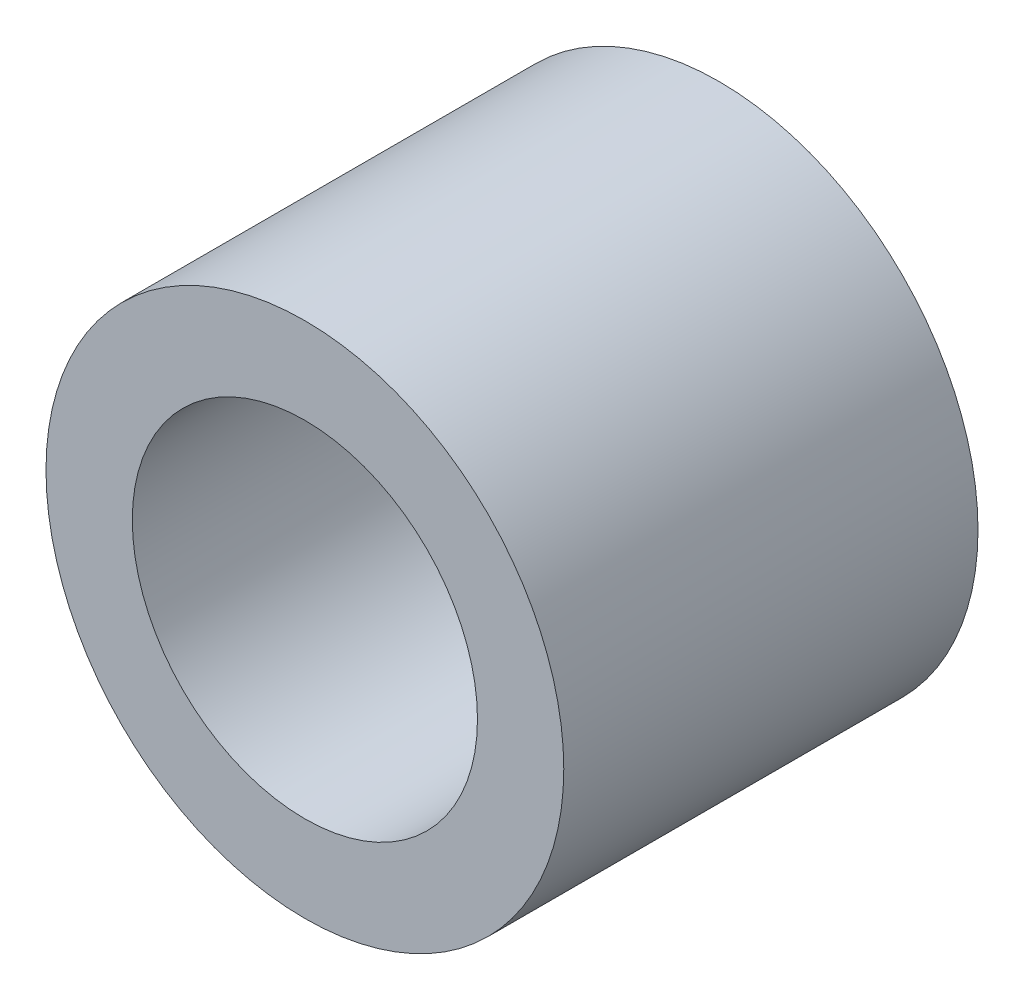
ISO-10303-21;
HEADER;
FILE_DESCRIPTION(('STEP AP214'),'2;1');
FILE_NAME('part.step','',(''),(''),'','','');
FILE_SCHEMA(('AUTOMOTIVE_DESIGN { 1 0 10303 214 1 1 1 1 }'));
ENDSEC;
DATA;
#1=APPLICATION_CONTEXT('core data for automotive mechanical design processes');
#2=APPLICATION_PROTOCOL_DEFINITION('international standard','automotive_design',2000,#1);
#3=PRODUCT_CONTEXT('',#1,'mechanical');
#4=PRODUCT('Part','Part','',(#3));
#5=PRODUCT_RELATED_PRODUCT_CATEGORY('part','',(#4));
#6=PRODUCT_DEFINITION_FORMATION('','',#4);
#7=PRODUCT_DEFINITION_CONTEXT('part definition',#1,'design');
#8=PRODUCT_DEFINITION('design','',#6,#7);
#9=PRODUCT_DEFINITION_SHAPE('','',#8);
#10=(LENGTH_UNIT() NAMED_UNIT(*) SI_UNIT(.MILLI.,.METRE.));
#11=(NAMED_UNIT(*) PLANE_ANGLE_UNIT() SI_UNIT($,.RADIAN.));
#12=(NAMED_UNIT(*) SI_UNIT($,.STERADIAN.) SOLID_ANGLE_UNIT());
#13=UNCERTAINTY_MEASURE_WITH_UNIT(LENGTH_MEASURE(1.E-05),#10,'distance_accuracy_value','');
#14=(GEOMETRIC_REPRESENTATION_CONTEXT(3) GLOBAL_UNCERTAINTY_ASSIGNED_CONTEXT((#13)) GLOBAL_UNIT_ASSIGNED_CONTEXT((#10,
#11,#12)) REPRESENTATION_CONTEXT('',''));
#15=CARTESIAN_POINT('',(0.,0.,0.));
#16=DIRECTION('',(0.,0.,1.));
#17=DIRECTION('',(1.,0.,0.));
#18=AXIS2_PLACEMENT_3D('',#15,#16,#17);
#19=CARTESIAN_POINT('',(0.,0.,15.24));
#20=DIRECTION('',(0.,0.,1.));
#21=DIRECTION('',(1.,0.,0.));
#22=AXIS2_PLACEMENT_3D('',#19,#20,#21);
#23=PLANE('',#22);
#24=CARTESIAN_POINT('',(0.,0.,15.24));
#25=DIRECTION('',(0.,0.,1.));
#26=DIRECTION('',(1.,0.,0.));
#27=AXIS2_PLACEMENT_3D('',#24,#25,#26);
#28=CIRCLE('',#27,9.525);
#29=CARTESIAN_POINT('',(9.525,0.,15.24));
#30=VERTEX_POINT('',#29);
#31=EDGE_CURVE('E10',#30,#30,#28,.T.);
#32=ORIENTED_EDGE('',*,*,#31,.T.);
#33=EDGE_LOOP('',(#32));
#34=FACE_BOUND('',#33,.T.);
#35=CARTESIAN_POINT('',(0.,0.,15.24));
#36=DIRECTION('',(0.,0.,1.));
#37=DIRECTION('',(1.,0.,0.));
#38=AXIS2_PLACEMENT_3D('',#35,#36,#37);
#39=CIRCLE('',#38,6.35);
#40=CARTESIAN_POINT('',(6.35,0.,15.24));
#41=VERTEX_POINT('',#40);
#42=EDGE_CURVE('E42',#41,#41,#39,.T.);
#43=ORIENTED_EDGE('',*,*,#42,.F.);
#44=EDGE_LOOP('',(#43));
#45=FACE_BOUND('',#44,.T.);
#46=ADVANCED_FACE('F31',(#34,#45),#23,.T.);
#47=CARTESIAN_POINT('',(0.,0.,0.));
#48=DIRECTION('',(0.,0.,1.));
#49=DIRECTION('',(1.,0.,0.));
#50=AXIS2_PLACEMENT_3D('',#47,#48,#49);
#51=PLANE('',#50);
#52=CARTESIAN_POINT('',(0.,0.,0.));
#53=DIRECTION('',(0.,0.,1.));
#54=DIRECTION('',(1.,0.,0.));
#55=AXIS2_PLACEMENT_3D('',#52,#53,#54);
#56=CIRCLE('',#55,9.525);
#57=CARTESIAN_POINT('',(9.525,0.,0.));
#58=VERTEX_POINT('',#57);
#59=EDGE_CURVE('E35',#58,#58,#56,.T.);
#60=ORIENTED_EDGE('',*,*,#59,.F.);
#61=EDGE_LOOP('',(#60));
#62=FACE_BOUND('',#61,.T.);
#63=CARTESIAN_POINT('',(0.,0.,0.));
#64=DIRECTION('',(0.,0.,1.));
#65=DIRECTION('',(1.,0.,0.));
#66=AXIS2_PLACEMENT_3D('',#63,#64,#65);
#67=CIRCLE('',#66,6.35);
#68=CARTESIAN_POINT('',(6.35,0.,0.));
#69=VERTEX_POINT('',#68);
#70=EDGE_CURVE('E44',#69,#69,#67,.T.);
#71=ORIENTED_EDGE('',*,*,#70,.T.);
#72=EDGE_LOOP('',(#71));
#73=FACE_BOUND('',#72,.T.);
#74=ADVANCED_FACE('F54',(#62,#73),#51,.F.);
#75=CARTESIAN_POINT('',(0.,0.,15.24));
#76=DIRECTION('',(0.,0.,-1.));
#77=DIRECTION('',(-1.,0.,0.));
#78=AXIS2_PLACEMENT_3D('',#75,#76,#77);
#79=CYLINDRICAL_SURFACE('',#78,9.525);
#80=ORIENTED_EDGE('',*,*,#31,.F.);
#81=EDGE_LOOP('',(#80));
#82=FACE_BOUND('',#81,.T.);
#83=ORIENTED_EDGE('',*,*,#59,.T.);
#84=EDGE_LOOP('',(#83));
#85=FACE_BOUND('',#84,.T.);
#86=ADVANCED_FACE('F33',(#82,#85),#79,.T.);
#87=CARTESIAN_POINT('',(0.,0.,15.24));
#88=DIRECTION('',(0.,0.,-1.));
#89=DIRECTION('',(-1.,0.,0.));
#90=AXIS2_PLACEMENT_3D('',#87,#88,#89);
#91=CYLINDRICAL_SURFACE('',#90,6.35);
#92=ORIENTED_EDGE('',*,*,#42,.T.);
#93=EDGE_LOOP('',(#92));
#94=FACE_BOUND('',#93,.T.);
#95=ORIENTED_EDGE('',*,*,#70,.F.);
#96=EDGE_LOOP('',(#95));
#97=FACE_BOUND('',#96,.T.);
#98=ADVANCED_FACE('F50',(#94,#97),#91,.F.);
#99=CLOSED_SHELL('',(#46,#74,#86,#98));
#100=MANIFOLD_SOLID_BREP('B2',#99);
#101=ADVANCED_BREP_SHAPE_REPRESENTATION('',(#18,#100),#14);
#102=SHAPE_DEFINITION_REPRESENTATION(#9,#101);
ENDSEC;
END-ISO-10303-21;
